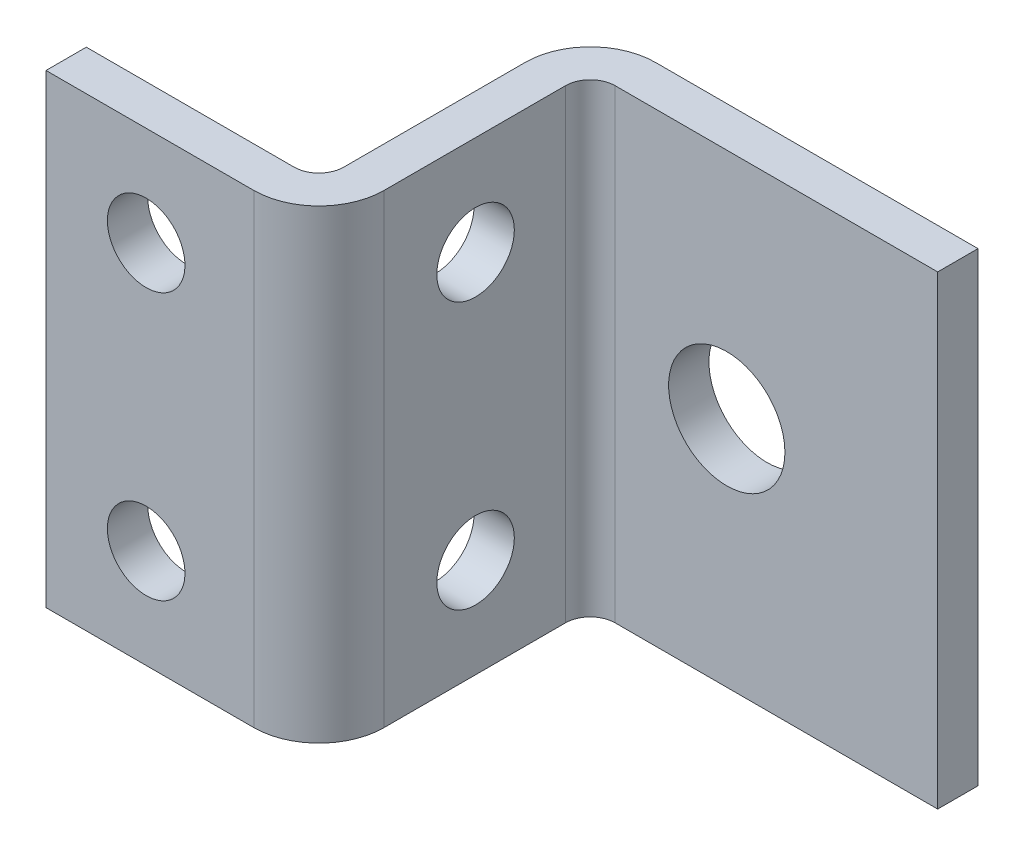
ISO-10303-21;
HEADER;
FILE_DESCRIPTION(('STEP AP214'),'2;1');
FILE_NAME('part.step','',(''),(''),'','','');
FILE_SCHEMA(('AUTOMOTIVE_DESIGN { 1 0 10303 214 1 1 1 1 }'));
ENDSEC;
DATA;
#1=APPLICATION_CONTEXT('core data for automotive mechanical design processes');
#2=APPLICATION_PROTOCOL_DEFINITION('international standard','automotive_design',2000,#1);
#3=PRODUCT_CONTEXT('',#1,'mechanical');
#4=PRODUCT('Part','Part','',(#3));
#5=PRODUCT_RELATED_PRODUCT_CATEGORY('part','',(#4));
#6=PRODUCT_DEFINITION_FORMATION('','',#4);
#7=PRODUCT_DEFINITION_CONTEXT('part definition',#1,'design');
#8=PRODUCT_DEFINITION('design','',#6,#7);
#9=PRODUCT_DEFINITION_SHAPE('','',#8);
#10=(LENGTH_UNIT() NAMED_UNIT(*) SI_UNIT(.MILLI.,.METRE.));
#11=(NAMED_UNIT(*) PLANE_ANGLE_UNIT() SI_UNIT($,.RADIAN.));
#12=(NAMED_UNIT(*) SI_UNIT($,.STERADIAN.) SOLID_ANGLE_UNIT());
#13=UNCERTAINTY_MEASURE_WITH_UNIT(LENGTH_MEASURE(1.E-05),#10,'distance_accuracy_value','');
#14=(GEOMETRIC_REPRESENTATION_CONTEXT(3) GLOBAL_UNCERTAINTY_ASSIGNED_CONTEXT((#13)) GLOBAL_UNIT_ASSIGNED_CONTEXT((#10,
#11,#12)) REPRESENTATION_CONTEXT('',''));
#15=CARTESIAN_POINT('',(0.,0.,0.));
#16=DIRECTION('',(0.,0.,1.));
#17=DIRECTION('',(1.,0.,0.));
#18=AXIS2_PLACEMENT_3D('',#15,#16,#17);
#19=CARTESIAN_POINT('',(-2.03200000000006,19.05,22.225));
#20=DIRECTION('',(0.,0.,-1.));
#21=DIRECTION('',(-1.,0.,0.));
#22=AXIS2_PLACEMENT_3D('',#19,#20,#21);
#23=PLANE('',#22);
#24=CARTESIAN_POINT('',(-10.8458,10.922,22.225));
#25=DIRECTION('',(0.,0.,-1.));
#26=DIRECTION('',(-1.,0.,0.));
#27=AXIS2_PLACEMENT_3D('',#24,#25,#26);
#28=CIRCLE('',#27,3.175);
#29=CARTESIAN_POINT('',(-14.0208,10.922,22.225));
#30=VERTEX_POINT('',#29);
#31=EDGE_CURVE('E171',#30,#30,#28,.F.);
#32=ORIENTED_EDGE('',*,*,#31,.T.);
#33=EDGE_LOOP('',(#32));
#34=FACE_BOUND('',#33,.T.);
#35=DIRECTION('',(1.,0.,0.));
#36=VECTOR('',#35,1.);
#37=CARTESIAN_POINT('',(-2.03200000000003,-19.05,22.225));
#38=LINE('',#37,#36);
#39=CARTESIAN_POINT('',(-19.0500000000001,-19.0500000000001,22.225));
#40=VERTEX_POINT('',#39);
#41=CARTESIAN_POINT('',(-2.03200000000003,-19.05,22.225));
#42=VERTEX_POINT('',#41);
#43=EDGE_CURVE('E186',#40,#42,#38,.T.);
#44=ORIENTED_EDGE('',*,*,#43,.F.);
#45=DIRECTION('',(0.,-1.,0.));
#46=VECTOR('',#45,1.);
#47=CARTESIAN_POINT('',(-19.0500000000001,19.05,22.225));
#48=LINE('',#47,#46);
#49=CARTESIAN_POINT('',(-19.0500000000001,19.05,22.225));
#50=VERTEX_POINT('',#49);
#51=EDGE_CURVE('E202',#50,#40,#48,.T.);
#52=ORIENTED_EDGE('',*,*,#51,.F.);
#53=DIRECTION('',(1.,0.,0.));
#54=VECTOR('',#53,1.);
#55=CARTESIAN_POINT('',(-2.03200000000006,19.05,22.225));
#56=LINE('',#55,#54);
#57=CARTESIAN_POINT('',(-2.03200000000006,19.05,22.225));
#58=VERTEX_POINT('',#57);
#59=EDGE_CURVE('E244',#50,#58,#56,.T.);
#60=ORIENTED_EDGE('',*,*,#59,.T.);
#61=DIRECTION('',(0.,-1.,0.));
#62=VECTOR('',#61,1.);
#63=CARTESIAN_POINT('',(-2.03200000000006,19.05,22.225));
#64=LINE('',#63,#62);
#65=EDGE_CURVE('E204',#58,#42,#64,.T.);
#66=ORIENTED_EDGE('',*,*,#65,.T.);
#67=EDGE_LOOP('',(#44,#52,#60,#66));
#68=FACE_BOUND('',#67,.T.);
#69=CARTESIAN_POINT('',(-10.8458,-10.9220000000001,22.225));
#70=DIRECTION('',(0.,0.,-1.));
#71=DIRECTION('',(-1.,0.,0.));
#72=AXIS2_PLACEMENT_3D('',#69,#70,#71);
#73=CIRCLE('',#72,3.175);
#74=CARTESIAN_POINT('',(-14.0208,-10.9220000000001,22.225));
#75=VERTEX_POINT('',#74);
#76=EDGE_CURVE('E269',#75,#75,#73,.F.);
#77=ORIENTED_EDGE('',*,*,#76,.T.);
#78=EDGE_LOOP('',(#77));
#79=FACE_BOUND('',#78,.T.);
#80=ADVANCED_FACE('F46',(#34,#68,#79),#23,.T.);
#81=CARTESIAN_POINT('',(-2.03200000000006,19.05,25.527));
#82=DIRECTION('',(0.,0.,-1.));
#83=DIRECTION('',(-1.,0.,0.));
#84=AXIS2_PLACEMENT_3D('',#81,#82,#83);
#85=PLANE('',#84);
#86=CARTESIAN_POINT('',(-10.8458,10.922,25.527));
#87=DIRECTION('',(0.,0.,-1.));
#88=DIRECTION('',(-1.,0.,0.));
#89=AXIS2_PLACEMENT_3D('',#86,#87,#88);
#90=CIRCLE('',#89,3.175);
#91=CARTESIAN_POINT('',(-14.0208,10.922,25.527));
#92=VERTEX_POINT('',#91);
#93=EDGE_CURVE('E273',#92,#92,#90,.T.);
#94=ORIENTED_EDGE('',*,*,#93,.T.);
#95=EDGE_LOOP('',(#94));
#96=FACE_BOUND('',#95,.T.);
#97=DIRECTION('',(1.,0.,0.));
#98=VECTOR('',#97,1.);
#99=CARTESIAN_POINT('',(-2.03200000000003,-19.05,25.527));
#100=LINE('',#99,#98);
#101=CARTESIAN_POINT('',(-19.0500000000001,-19.0500000000001,25.527));
#102=VERTEX_POINT('',#101);
#103=CARTESIAN_POINT('',(-2.03200000000003,-19.05,25.527));
#104=VERTEX_POINT('',#103);
#105=EDGE_CURVE('E192',#102,#104,#100,.T.);
#106=ORIENTED_EDGE('',*,*,#105,.T.);
#107=DIRECTION('',(0.,-1.,0.));
#108=VECTOR('',#107,1.);
#109=CARTESIAN_POINT('',(-2.03200000000006,19.05,25.527));
#110=LINE('',#109,#108);
#111=CARTESIAN_POINT('',(-2.03200000000006,19.05,25.527));
#112=VERTEX_POINT('',#111);
#113=EDGE_CURVE('E158',#112,#104,#110,.T.);
#114=ORIENTED_EDGE('',*,*,#113,.F.);
#115=DIRECTION('',(1.,0.,0.));
#116=VECTOR('',#115,1.);
#117=CARTESIAN_POINT('',(-2.03200000000006,19.05,25.527));
#118=LINE('',#117,#116);
#119=CARTESIAN_POINT('',(-19.0500000000001,19.05,25.527));
#120=VERTEX_POINT('',#119);
#121=EDGE_CURVE('E149',#120,#112,#118,.T.);
#122=ORIENTED_EDGE('',*,*,#121,.F.);
#123=DIRECTION('',(0.,-1.,0.));
#124=VECTOR('',#123,1.);
#125=CARTESIAN_POINT('',(-19.0500000000001,19.05,25.527));
#126=LINE('',#125,#124);
#127=EDGE_CURVE('E200',#120,#102,#126,.T.);
#128=ORIENTED_EDGE('',*,*,#127,.T.);
#129=EDGE_LOOP('',(#106,#114,#122,#128));
#130=FACE_BOUND('',#129,.T.);
#131=CARTESIAN_POINT('',(-10.8458,-10.9220000000001,25.527));
#132=DIRECTION('',(0.,0.,-1.));
#133=DIRECTION('',(-1.,0.,0.));
#134=AXIS2_PLACEMENT_3D('',#131,#132,#133);
#135=CIRCLE('',#134,3.175);
#136=CARTESIAN_POINT('',(-14.0208,-10.9220000000001,25.527));
#137=VERTEX_POINT('',#136);
#138=EDGE_CURVE('E267',#137,#137,#135,.T.);
#139=ORIENTED_EDGE('',*,*,#138,.T.);
#140=EDGE_LOOP('',(#139));
#141=FACE_BOUND('',#140,.T.);
#142=ADVANCED_FACE('F260',(#96,#130,#141),#85,.F.);
#143=CARTESIAN_POINT('',(5.334,19.05,3.302));
#144=DIRECTION('',(0.,0.,-1.));
#145=DIRECTION('',(-1.,0.,0.));
#146=AXIS2_PLACEMENT_3D('',#143,#144,#145);
#147=PLANE('',#146);
#148=CARTESIAN_POINT('',(14.478,0.,3.302));
#149=DIRECTION('',(0.,0.,1.));
#150=DIRECTION('',(1.,0.,0.));
#151=AXIS2_PLACEMENT_3D('',#148,#149,#150);
#152=CIRCLE('',#151,4.7625);
#153=CARTESIAN_POINT('',(19.2405,0.,3.302));
#154=VERTEX_POINT('',#153);
#155=EDGE_CURVE('E329',#154,#154,#152,.T.);
#156=ORIENTED_EDGE('',*,*,#155,.F.);
#157=EDGE_LOOP('',(#156));
#158=FACE_BOUND('',#157,.T.);
#159=DIRECTION('',(1.,0.,0.));
#160=VECTOR('',#159,1.);
#161=CARTESIAN_POINT('',(5.334,-19.05,3.302));
#162=LINE('',#161,#160);
#163=CARTESIAN_POINT('',(5.334,-19.05,3.302));
#164=VERTEX_POINT('',#163);
#165=CARTESIAN_POINT('',(31.75,-19.05,3.302));
#166=VERTEX_POINT('',#165);
#167=EDGE_CURVE('E167',#164,#166,#162,.T.);
#168=ORIENTED_EDGE('',*,*,#167,.T.);
#169=DIRECTION('',(0.,-1.,0.));
#170=VECTOR('',#169,1.);
#171=CARTESIAN_POINT('',(31.75,19.05,3.302));
#172=LINE('',#171,#170);
#173=CARTESIAN_POINT('',(31.75,19.05,3.302));
#174=VERTEX_POINT('',#173);
#175=EDGE_CURVE('E13',#174,#166,#172,.T.);
#176=ORIENTED_EDGE('',*,*,#175,.F.);
#177=DIRECTION('',(1.,0.,0.));
#178=VECTOR('',#177,1.);
#179=CARTESIAN_POINT('',(5.334,19.05,3.302));
#180=LINE('',#179,#178);
#181=CARTESIAN_POINT('',(5.334,19.05,3.302));
#182=VERTEX_POINT('',#181);
#183=EDGE_CURVE('E115',#182,#174,#180,.T.);
#184=ORIENTED_EDGE('',*,*,#183,.F.);
#185=DIRECTION('',(0.,-1.,0.));
#186=VECTOR('',#185,1.);
#187=CARTESIAN_POINT('',(5.334,19.05,3.302));
#188=LINE('',#187,#186);
#189=EDGE_CURVE('E163',#182,#164,#188,.T.);
#190=ORIENTED_EDGE('',*,*,#189,.T.);
#191=EDGE_LOOP('',(#168,#176,#184,#190));
#192=FACE_BOUND('',#191,.T.);
#193=ADVANCED_FACE('F48',(#158,#192),#147,.F.);
#194=CARTESIAN_POINT('',(31.75,19.05,0.));
#195=DIRECTION('',(1.,0.,0.));
#196=DIRECTION('',(0.,0.,-1.));
#197=AXIS2_PLACEMENT_3D('',#194,#195,#196);
#198=PLANE('',#197);
#199=DIRECTION('',(0.,0.,1.));
#200=VECTOR('',#199,1.);
#201=CARTESIAN_POINT('',(31.75,-19.05,0.));
#202=LINE('',#201,#200);
#203=CARTESIAN_POINT('',(31.75,-19.05,0.));
#204=VERTEX_POINT('',#203);
#205=EDGE_CURVE('E170',#204,#166,#202,.T.);
#206=ORIENTED_EDGE('',*,*,#205,.F.);
#207=DIRECTION('',(0.,-1.,0.));
#208=VECTOR('',#207,1.);
#209=CARTESIAN_POINT('',(31.75,19.05,0.));
#210=LINE('',#209,#208);
#211=CARTESIAN_POINT('',(31.75,19.05,0.));
#212=VERTEX_POINT('',#211);
#213=EDGE_CURVE('E55',#212,#204,#210,.T.);
#214=ORIENTED_EDGE('',*,*,#213,.F.);
#215=DIRECTION('',(0.,0.,1.));
#216=VECTOR('',#215,1.);
#217=CARTESIAN_POINT('',(31.75,19.05,0.));
#218=LINE('',#217,#216);
#219=EDGE_CURVE('E233',#212,#174,#218,.T.);
#220=ORIENTED_EDGE('',*,*,#219,.T.);
#221=ORIENTED_EDGE('',*,*,#175,.T.);
#222=EDGE_LOOP('',(#206,#214,#220,#221));
#223=FACE_BOUND('',#222,.T.);
#224=ADVANCED_FACE('F220',(#223),#198,.T.);
#225=CARTESIAN_POINT('',(5.334,19.05,0.));
#226=DIRECTION('',(0.,0.,-1.));
#227=DIRECTION('',(-1.,0.,0.));
#228=AXIS2_PLACEMENT_3D('',#225,#226,#227);
#229=PLANE('',#228);
#230=CARTESIAN_POINT('',(14.478,0.,0.));
#231=DIRECTION('',(0.,0.,1.));
#232=DIRECTION('',(1.,0.,0.));
#233=AXIS2_PLACEMENT_3D('',#230,#231,#232);
#234=CIRCLE('',#233,4.7625);
#235=CARTESIAN_POINT('',(19.2405,0.,0.));
#236=VERTEX_POINT('',#235);
#237=EDGE_CURVE('E422',#236,#236,#234,.T.);
#238=ORIENTED_EDGE('',*,*,#237,.T.);
#239=EDGE_LOOP('',(#238));
#240=FACE_BOUND('',#239,.T.);
#241=DIRECTION('',(1.,0.,0.));
#242=VECTOR('',#241,1.);
#243=CARTESIAN_POINT('',(5.334,-19.05,0.));
#244=LINE('',#243,#242);
#245=CARTESIAN_POINT('',(5.334,-19.05,0.));
#246=VERTEX_POINT('',#245);
#247=EDGE_CURVE('E174',#246,#204,#244,.T.);
#248=ORIENTED_EDGE('',*,*,#247,.F.);
#249=DIRECTION('',(0.,-1.,0.));
#250=VECTOR('',#249,1.);
#251=CARTESIAN_POINT('',(5.334,19.05,0.));
#252=LINE('',#251,#250);
#253=CARTESIAN_POINT('',(5.334,19.05,0.));
#254=VERTEX_POINT('',#253);
#255=EDGE_CURVE('E210',#254,#246,#252,.T.);
#256=ORIENTED_EDGE('',*,*,#255,.F.);
#257=DIRECTION('',(1.,0.,0.));
#258=VECTOR('',#257,1.);
#259=CARTESIAN_POINT('',(5.334,19.05,0.));
#260=LINE('',#259,#258);
#261=EDGE_CURVE('E217',#254,#212,#260,.T.);
#262=ORIENTED_EDGE('',*,*,#261,.T.);
#263=ORIENTED_EDGE('',*,*,#213,.T.);
#264=EDGE_LOOP('',(#248,#256,#262,#263));
#265=FACE_BOUND('',#264,.T.);
#266=ADVANCED_FACE('F215',(#240,#265),#229,.T.);
#267=CARTESIAN_POINT('',(5.334,19.05,5.334));
#268=DIRECTION('',(0.,-1.,0.));
#269=DIRECTION('',(0.,0.,-1.));
#270=AXIS2_PLACEMENT_3D('',#267,#268,#269);
#271=CYLINDRICAL_SURFACE('',#270,5.334);
#272=CARTESIAN_POINT('',(5.334,-19.05,5.334));
#273=DIRECTION('',(0.,-1.,0.));
#274=DIRECTION('',(0.,0.,-1.));
#275=AXIS2_PLACEMENT_3D('',#272,#273,#274);
#276=CIRCLE('',#275,5.334);
#277=CARTESIAN_POINT('',(0.,-19.0500000000001,5.334));
#278=VERTEX_POINT('',#277);
#279=EDGE_CURVE('E177',#278,#246,#276,.T.);
#280=ORIENTED_EDGE('',*,*,#279,.F.);
#281=DIRECTION('',(0.,-1.,0.));
#282=VECTOR('',#281,1.);
#283=CARTESIAN_POINT('',(0.,19.05,5.334));
#284=LINE('',#283,#282);
#285=CARTESIAN_POINT('',(0.,19.05,5.334));
#286=VERTEX_POINT('',#285);
#287=EDGE_CURVE('E208',#286,#278,#284,.T.);
#288=ORIENTED_EDGE('',*,*,#287,.F.);
#289=CARTESIAN_POINT('',(5.334,19.05,5.334));
#290=DIRECTION('',(0.,-1.,0.));
#291=DIRECTION('',(0.,0.,-1.));
#292=AXIS2_PLACEMENT_3D('',#289,#290,#291);
#293=CIRCLE('',#292,5.334);
#294=EDGE_CURVE('E230',#286,#254,#293,.T.);
#295=ORIENTED_EDGE('',*,*,#294,.T.);
#296=ORIENTED_EDGE('',*,*,#255,.T.);
#297=EDGE_LOOP('',(#280,#288,#295,#296));
#298=FACE_BOUND('',#297,.T.);
#299=ADVANCED_FACE('F227',(#298),#271,.T.);
#300=CARTESIAN_POINT('',(0.,19.05,20.193));
#301=DIRECTION('',(-1.,0.,0.));
#302=DIRECTION('',(0.,0.,1.));
#303=AXIS2_PLACEMENT_3D('',#300,#301,#302);
#304=PLANE('',#303);
#305=CARTESIAN_POINT('',(0.,-10.922,12.7));
#306=DIRECTION('',(-1.,0.,0.));
#307=DIRECTION('',(0.,0.,1.));
#308=AXIS2_PLACEMENT_3D('',#305,#306,#307);
#309=CIRCLE('',#308,3.175);
#310=CARTESIAN_POINT('',(0.,-10.922,15.875));
#311=VERTEX_POINT('',#310);
#312=EDGE_CURVE('E429',#311,#311,#309,.T.);
#313=ORIENTED_EDGE('',*,*,#312,.F.);
#314=EDGE_LOOP('',(#313));
#315=FACE_BOUND('',#314,.T.);
#316=CARTESIAN_POINT('',(0.,10.922,12.7));
#317=DIRECTION('',(-1.,0.,0.));
#318=DIRECTION('',(0.,0.,1.));
#319=AXIS2_PLACEMENT_3D('',#316,#317,#318);
#320=CIRCLE('',#319,3.175);
#321=CARTESIAN_POINT('',(0.,10.922,15.875));
#322=VERTEX_POINT('',#321);
#323=EDGE_CURVE('E270',#322,#322,#320,.T.);
#324=ORIENTED_EDGE('',*,*,#323,.F.);
#325=EDGE_LOOP('',(#324));
#326=FACE_BOUND('',#325,.T.);
#327=DIRECTION('',(0.,0.,-1.));
#328=VECTOR('',#327,1.);
#329=CARTESIAN_POINT('',(0.,-19.0500000000001,20.193));
#330=LINE('',#329,#328);
#331=CARTESIAN_POINT('',(0.,-19.0500000000001,20.193));
#332=VERTEX_POINT('',#331);
#333=EDGE_CURVE('E180',#332,#278,#330,.T.);
#334=ORIENTED_EDGE('',*,*,#333,.F.);
#335=DIRECTION('',(0.,-1.,0.));
#336=VECTOR('',#335,1.);
#337=CARTESIAN_POINT('',(0.,19.05,20.193));
#338=LINE('',#337,#336);
#339=CARTESIAN_POINT('',(0.,19.05,20.193));
#340=VERTEX_POINT('',#339);
#341=EDGE_CURVE('E206',#340,#332,#338,.T.);
#342=ORIENTED_EDGE('',*,*,#341,.F.);
#343=DIRECTION('',(0.,0.,-1.));
#344=VECTOR('',#343,1.);
#345=CARTESIAN_POINT('',(0.,19.05,20.193));
#346=LINE('',#345,#344);
#347=EDGE_CURVE('E235',#340,#286,#346,.T.);
#348=ORIENTED_EDGE('',*,*,#347,.T.);
#349=ORIENTED_EDGE('',*,*,#287,.T.);
#350=EDGE_LOOP('',(#334,#342,#348,#349));
#351=FACE_BOUND('',#350,.T.);
#352=ADVANCED_FACE('F310',(#315,#326,#351),#304,.T.);
#353=CARTESIAN_POINT('',(-2.03200000000006,19.05,20.193));
#354=DIRECTION('',(0.,-1.,0.));
#355=DIRECTION('',(0.,0.,-1.));
#356=AXIS2_PLACEMENT_3D('',#353,#354,#355);
#357=CYLINDRICAL_SURFACE('',#356,2.032);
#358=CARTESIAN_POINT('',(-2.03200000000003,-19.05,20.193));
#359=DIRECTION('',(0.,1.,0.));
#360=DIRECTION('',(0.,0.,-1.));
#361=AXIS2_PLACEMENT_3D('',#358,#359,#360);
#362=CIRCLE('',#361,2.032);
#363=EDGE_CURVE('E183',#42,#332,#362,.T.);
#364=ORIENTED_EDGE('',*,*,#363,.F.);
#365=ORIENTED_EDGE('',*,*,#65,.F.);
#366=CARTESIAN_POINT('',(-2.03200000000006,19.05,20.193));
#367=DIRECTION('',(0.,1.,0.));
#368=DIRECTION('',(0.,0.,-1.));
#369=AXIS2_PLACEMENT_3D('',#366,#367,#368);
#370=CIRCLE('',#369,2.032);
#371=EDGE_CURVE('E241',#58,#340,#370,.T.);
#372=ORIENTED_EDGE('',*,*,#371,.T.);
#373=ORIENTED_EDGE('',*,*,#341,.T.);
#374=EDGE_LOOP('',(#364,#365,#372,#373));
#375=FACE_BOUND('',#374,.T.);
#376=ADVANCED_FACE('F307',(#375),#357,.F.);
#377=CARTESIAN_POINT('',(-19.0500000000001,19.05,25.527));
#378=DIRECTION('',(-1.,0.,0.));
#379=DIRECTION('',(0.,0.,1.));
#380=AXIS2_PLACEMENT_3D('',#377,#378,#379);
#381=PLANE('',#380);
#382=DIRECTION('',(0.,0.,-1.));
#383=VECTOR('',#382,1.);
#384=CARTESIAN_POINT('',(-19.0500000000001,-19.0500000000001,25.527));
#385=LINE('',#384,#383);
#386=EDGE_CURVE('E189',#102,#40,#385,.T.);
#387=ORIENTED_EDGE('',*,*,#386,.F.);
#388=ORIENTED_EDGE('',*,*,#127,.F.);
#389=DIRECTION('',(0.,0.,-1.));
#390=VECTOR('',#389,1.);
#391=CARTESIAN_POINT('',(-19.0500000000001,19.05,25.527));
#392=LINE('',#391,#390);
#393=EDGE_CURVE('E247',#120,#50,#392,.T.);
#394=ORIENTED_EDGE('',*,*,#393,.T.);
#395=ORIENTED_EDGE('',*,*,#51,.T.);
#396=EDGE_LOOP('',(#387,#388,#394,#395));
#397=FACE_BOUND('',#396,.T.);
#398=ADVANCED_FACE('F251',(#397),#381,.T.);
#399=CARTESIAN_POINT('',(-2.03200000000006,19.05,20.193));
#400=DIRECTION('',(0.,-1.,0.));
#401=DIRECTION('',(0.,0.,-1.));
#402=AXIS2_PLACEMENT_3D('',#399,#400,#401);
#403=CYLINDRICAL_SURFACE('',#402,5.334);
#404=CARTESIAN_POINT('',(-2.03200000000003,-19.05,20.193));
#405=DIRECTION('',(0.,1.,0.));
#406=DIRECTION('',(1.,0.,0.));
#407=AXIS2_PLACEMENT_3D('',#404,#405,#406);
#408=CIRCLE('',#407,5.334);
#409=CARTESIAN_POINT('',(3.30199999999992,-19.0500000000001,20.193));
#410=VERTEX_POINT('',#409);
#411=EDGE_CURVE('E157',#104,#410,#408,.T.);
#412=ORIENTED_EDGE('',*,*,#411,.T.);
#413=DIRECTION('',(0.,-1.,0.));
#414=VECTOR('',#413,1.);
#415=CARTESIAN_POINT('',(3.30199999999997,19.05,20.193));
#416=LINE('',#415,#414);
#417=CARTESIAN_POINT('',(3.30199999999997,19.05,20.193));
#418=VERTEX_POINT('',#417);
#419=EDGE_CURVE('E154',#418,#410,#416,.T.);
#420=ORIENTED_EDGE('',*,*,#419,.F.);
#421=CARTESIAN_POINT('',(-2.03200000000006,19.05,20.193));
#422=DIRECTION('',(0.,1.,0.));
#423=DIRECTION('',(1.,0.,0.));
#424=AXIS2_PLACEMENT_3D('',#421,#422,#423);
#425=CIRCLE('',#424,5.334);
#426=EDGE_CURVE('E142',#112,#418,#425,.T.);
#427=ORIENTED_EDGE('',*,*,#426,.F.);
#428=ORIENTED_EDGE('',*,*,#113,.T.);
#429=EDGE_LOOP('',(#412,#420,#427,#428));
#430=FACE_BOUND('',#429,.T.);
#431=ADVANCED_FACE('F155',(#430),#403,.T.);
#432=CARTESIAN_POINT('',(3.30199999999997,19.05,20.193));
#433=DIRECTION('',(-1.,0.,0.));
#434=DIRECTION('',(0.,0.,1.));
#435=AXIS2_PLACEMENT_3D('',#432,#433,#434);
#436=PLANE('',#435);
#437=CARTESIAN_POINT('',(3.30199999999997,-10.922,12.7));
#438=DIRECTION('',(1.,0.,0.));
#439=DIRECTION('',(0.,0.,-1.));
#440=AXIS2_PLACEMENT_3D('',#437,#438,#439);
#441=CIRCLE('',#440,3.175);
#442=CARTESIAN_POINT('',(3.30199999999997,-10.922,9.525));
#443=VERTEX_POINT('',#442);
#444=EDGE_CURVE('E424',#443,#443,#441,.T.);
#445=ORIENTED_EDGE('',*,*,#444,.F.);
#446=EDGE_LOOP('',(#445));
#447=FACE_BOUND('',#446,.T.);
#448=CARTESIAN_POINT('',(3.30199999999994,10.922,12.7));
#449=DIRECTION('',(1.,0.,0.));
#450=DIRECTION('',(0.,0.,-1.));
#451=AXIS2_PLACEMENT_3D('',#448,#449,#450);
#452=CIRCLE('',#451,3.175);
#453=CARTESIAN_POINT('',(3.30199999999994,10.922,9.525));
#454=VERTEX_POINT('',#453);
#455=EDGE_CURVE('E276',#454,#454,#452,.T.);
#456=ORIENTED_EDGE('',*,*,#455,.F.);
#457=EDGE_LOOP('',(#456));
#458=FACE_BOUND('',#457,.T.);
#459=DIRECTION('',(0.,0.,-1.));
#460=VECTOR('',#459,1.);
#461=CARTESIAN_POINT('',(3.30199999999992,-19.0500000000001,20.193));
#462=LINE('',#461,#460);
#463=CARTESIAN_POINT('',(3.30199999999992,-19.0500000000001,5.334));
#464=VERTEX_POINT('',#463);
#465=EDGE_CURVE('E103',#410,#464,#462,.T.);
#466=ORIENTED_EDGE('',*,*,#465,.T.);
#467=DIRECTION('',(0.,-1.,0.));
#468=VECTOR('',#467,1.);
#469=CARTESIAN_POINT('',(3.30199999999997,19.05,5.334));
#470=LINE('',#469,#468);
#471=CARTESIAN_POINT('',(3.30199999999997,19.05,5.334));
#472=VERTEX_POINT('',#471);
#473=EDGE_CURVE('E159',#472,#464,#470,.T.);
#474=ORIENTED_EDGE('',*,*,#473,.F.);
#475=DIRECTION('',(0.,0.,-1.));
#476=VECTOR('',#475,1.);
#477=CARTESIAN_POINT('',(3.30199999999997,19.05,20.193));
#478=LINE('',#477,#476);
#479=EDGE_CURVE('E146',#418,#472,#478,.T.);
#480=ORIENTED_EDGE('',*,*,#479,.F.);
#481=ORIENTED_EDGE('',*,*,#419,.T.);
#482=EDGE_LOOP('',(#466,#474,#480,#481));
#483=FACE_BOUND('',#482,.T.);
#484=ADVANCED_FACE('F161',(#447,#458,#483),#436,.F.);
#485=CARTESIAN_POINT('',(5.334,19.05,5.334));
#486=DIRECTION('',(0.,-1.,0.));
#487=DIRECTION('',(0.,0.,-1.));
#488=AXIS2_PLACEMENT_3D('',#485,#486,#487);
#489=CYLINDRICAL_SURFACE('',#488,2.032);
#490=CARTESIAN_POINT('',(5.334,-19.05,5.334));
#491=DIRECTION('',(0.,1.,0.));
#492=DIRECTION('',(1.,0.,0.));
#493=AXIS2_PLACEMENT_3D('',#490,#491,#492);
#494=CIRCLE('',#493,2.032);
#495=EDGE_CURVE('E109',#464,#164,#494,.F.);
#496=ORIENTED_EDGE('',*,*,#495,.T.);
#497=ORIENTED_EDGE('',*,*,#189,.F.);
#498=CARTESIAN_POINT('',(5.334,19.05,5.334));
#499=DIRECTION('',(0.,1.,0.));
#500=DIRECTION('',(1.,0.,0.));
#501=AXIS2_PLACEMENT_3D('',#498,#499,#500);
#502=CIRCLE('',#501,2.032);
#503=EDGE_CURVE('E63',#472,#182,#502,.F.);
#504=ORIENTED_EDGE('',*,*,#503,.F.);
#505=ORIENTED_EDGE('',*,*,#473,.T.);
#506=EDGE_LOOP('',(#496,#497,#504,#505));
#507=FACE_BOUND('',#506,.T.);
#508=ADVANCED_FACE('F330',(#507),#489,.F.);
#509=CARTESIAN_POINT('',(5.334,19.05,5.334));
#510=DIRECTION('',(0.,-1.,0.));
#511=DIRECTION('',(-1.,0.,0.));
#512=AXIS2_PLACEMENT_3D('',#509,#510,#511);
#513=PLANE('',#512);
#514=ORIENTED_EDGE('',*,*,#183,.T.);
#515=ORIENTED_EDGE('',*,*,#219,.F.);
#516=ORIENTED_EDGE('',*,*,#261,.F.);
#517=ORIENTED_EDGE('',*,*,#294,.F.);
#518=ORIENTED_EDGE('',*,*,#347,.F.);
#519=ORIENTED_EDGE('',*,*,#371,.F.);
#520=ORIENTED_EDGE('',*,*,#59,.F.);
#521=ORIENTED_EDGE('',*,*,#393,.F.);
#522=ORIENTED_EDGE('',*,*,#121,.T.);
#523=ORIENTED_EDGE('',*,*,#426,.T.);
#524=ORIENTED_EDGE('',*,*,#479,.T.);
#525=ORIENTED_EDGE('',*,*,#503,.T.);
#526=EDGE_LOOP('',(#514,#515,#516,#517,#518,#519,#520,#521,#522,#523,#524,#525));
#527=FACE_BOUND('',#526,.T.);
#528=ADVANCED_FACE('F144',(#527),#513,.F.);
#529=CARTESIAN_POINT('',(5.334,-19.05,5.334));
#530=DIRECTION('',(0.,-1.,0.));
#531=DIRECTION('',(-1.,0.,0.));
#532=AXIS2_PLACEMENT_3D('',#529,#530,#531);
#533=PLANE('',#532);
#534=ORIENTED_EDGE('',*,*,#167,.F.);
#535=ORIENTED_EDGE('',*,*,#495,.F.);
#536=ORIENTED_EDGE('',*,*,#465,.F.);
#537=ORIENTED_EDGE('',*,*,#411,.F.);
#538=ORIENTED_EDGE('',*,*,#105,.F.);
#539=ORIENTED_EDGE('',*,*,#386,.T.);
#540=ORIENTED_EDGE('',*,*,#43,.T.);
#541=ORIENTED_EDGE('',*,*,#363,.T.);
#542=ORIENTED_EDGE('',*,*,#333,.T.);
#543=ORIENTED_EDGE('',*,*,#279,.T.);
#544=ORIENTED_EDGE('',*,*,#247,.T.);
#545=ORIENTED_EDGE('',*,*,#205,.T.);
#546=EDGE_LOOP('',(#534,#535,#536,#537,#538,#539,#540,#541,#542,#543,#544,#545));
#547=FACE_BOUND('',#546,.T.);
#548=ADVANCED_FACE('F223',(#547),#533,.T.);
#549=CARTESIAN_POINT('',(-10.8458,10.922,0.));
#550=DIRECTION('',(0.,0.,1.));
#551=DIRECTION('',(1.,0.,0.));
#552=AXIS2_PLACEMENT_3D('',#549,#550,#551);
#553=CYLINDRICAL_SURFACE('',#552,3.175);
#554=ORIENTED_EDGE('',*,*,#31,.F.);
#555=EDGE_LOOP('',(#554));
#556=FACE_BOUND('',#555,.T.);
#557=ORIENTED_EDGE('',*,*,#93,.F.);
#558=EDGE_LOOP('',(#557));
#559=FACE_BOUND('',#558,.T.);
#560=ADVANCED_FACE('F286',(#556,#559),#553,.F.);
#561=CARTESIAN_POINT('',(-10.8458,-10.9220000000001,0.));
#562=DIRECTION('',(0.,0.,1.));
#563=DIRECTION('',(1.,0.,0.));
#564=AXIS2_PLACEMENT_3D('',#561,#562,#563);
#565=CYLINDRICAL_SURFACE('',#564,3.175);
#566=ORIENTED_EDGE('',*,*,#76,.F.);
#567=EDGE_LOOP('',(#566));
#568=FACE_BOUND('',#567,.T.);
#569=ORIENTED_EDGE('',*,*,#138,.F.);
#570=EDGE_LOOP('',(#569));
#571=FACE_BOUND('',#570,.T.);
#572=ADVANCED_FACE('F289',(#568,#571),#565,.F.);
#573=CARTESIAN_POINT('',(-19.0500000000001,10.922,12.7));
#574=DIRECTION('',(1.,0.,0.));
#575=DIRECTION('',(0.,0.,-1.));
#576=AXIS2_PLACEMENT_3D('',#573,#574,#575);
#577=CYLINDRICAL_SURFACE('',#576,3.175);
#578=ORIENTED_EDGE('',*,*,#323,.T.);
#579=EDGE_LOOP('',(#578));
#580=FACE_BOUND('',#579,.T.);
#581=ORIENTED_EDGE('',*,*,#455,.T.);
#582=EDGE_LOOP('',(#581));
#583=FACE_BOUND('',#582,.T.);
#584=ADVANCED_FACE('F296',(#580,#583),#577,.F.);
#585=CARTESIAN_POINT('',(-19.0500000000001,-10.922,12.7));
#586=DIRECTION('',(1.,0.,0.));
#587=DIRECTION('',(0.,0.,-1.));
#588=AXIS2_PLACEMENT_3D('',#585,#586,#587);
#589=CYLINDRICAL_SURFACE('',#588,3.175);
#590=ORIENTED_EDGE('',*,*,#312,.T.);
#591=EDGE_LOOP('',(#590));
#592=FACE_BOUND('',#591,.T.);
#593=ORIENTED_EDGE('',*,*,#444,.T.);
#594=EDGE_LOOP('',(#593));
#595=FACE_BOUND('',#594,.T.);
#596=ADVANCED_FACE('F401',(#592,#595),#589,.F.);
#597=CARTESIAN_POINT('',(14.478,0.,0.));
#598=DIRECTION('',(0.,0.,1.));
#599=DIRECTION('',(1.,0.,0.));
#600=AXIS2_PLACEMENT_3D('',#597,#598,#599);
#601=CYLINDRICAL_SURFACE('',#600,4.7625);
#602=ORIENTED_EDGE('',*,*,#237,.F.);
#603=EDGE_LOOP('',(#602));
#604=FACE_BOUND('',#603,.T.);
#605=ORIENTED_EDGE('',*,*,#155,.T.);
#606=EDGE_LOOP('',(#605));
#607=FACE_BOUND('',#606,.T.);
#608=ADVANCED_FACE('F409',(#604,#607),#601,.F.);
#609=CLOSED_SHELL('',(#80,#142,#193,#224,#266,#299,#352,#376,#398,#431,#484,#508,#528,#548,#560,
#572,#584,#596,#608));
#610=MANIFOLD_SOLID_BREP('B2',#609);
#611=ADVANCED_BREP_SHAPE_REPRESENTATION('',(#18,#610),#14);
#612=SHAPE_DEFINITION_REPRESENTATION(#9,#611);
ENDSEC;
END-ISO-10303-21;
